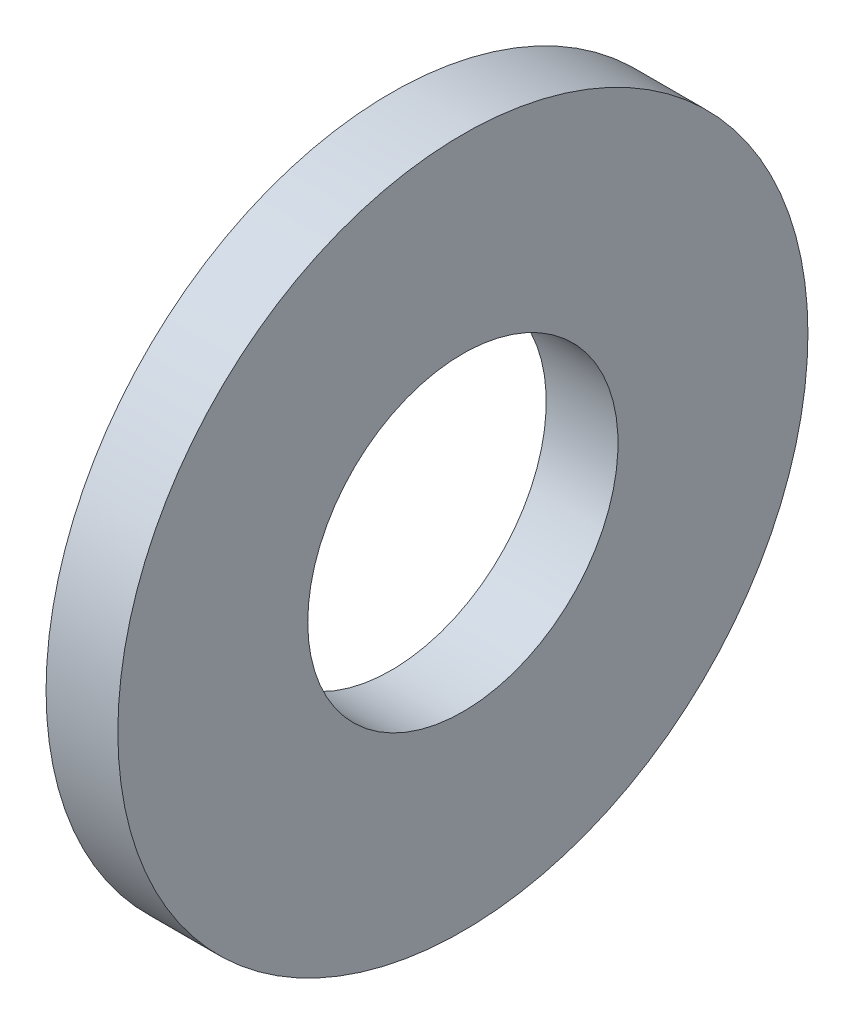
ISO-10303-21;
HEADER;
FILE_DESCRIPTION(('STEP AP214'),'2;1');
FILE_NAME('part.step','',(''),(''),'','','');
FILE_SCHEMA(('AUTOMOTIVE_DESIGN { 1 0 10303 214 1 1 1 1 }'));
ENDSEC;
DATA;
#1=APPLICATION_CONTEXT('core data for automotive mechanical design processes');
#2=APPLICATION_PROTOCOL_DEFINITION('international standard','automotive_design',2000,#1);
#3=PRODUCT_CONTEXT('',#1,'mechanical');
#4=PRODUCT('Part','Part','',(#3));
#5=PRODUCT_RELATED_PRODUCT_CATEGORY('part','',(#4));
#6=PRODUCT_DEFINITION_FORMATION('','',#4);
#7=PRODUCT_DEFINITION_CONTEXT('part definition',#1,'design');
#8=PRODUCT_DEFINITION('design','',#6,#7);
#9=PRODUCT_DEFINITION_SHAPE('','',#8);
#10=(LENGTH_UNIT() NAMED_UNIT(*) SI_UNIT(.MILLI.,.METRE.));
#11=(NAMED_UNIT(*) PLANE_ANGLE_UNIT() SI_UNIT($,.RADIAN.));
#12=(NAMED_UNIT(*) SI_UNIT($,.STERADIAN.) SOLID_ANGLE_UNIT());
#13=UNCERTAINTY_MEASURE_WITH_UNIT(LENGTH_MEASURE(1.E-05),#10,'distance_accuracy_value','');
#14=(GEOMETRIC_REPRESENTATION_CONTEXT(3) GLOBAL_UNCERTAINTY_ASSIGNED_CONTEXT((#13)) GLOBAL_UNIT_ASSIGNED_CONTEXT((#10,
#11,#12)) REPRESENTATION_CONTEXT('',''));
#15=CARTESIAN_POINT('',(0.,0.,0.));
#16=DIRECTION('',(0.,0.,1.));
#17=DIRECTION('',(1.,0.,0.));
#18=AXIS2_PLACEMENT_3D('',#15,#16,#17);
#19=CARTESIAN_POINT('',(-34.9249999999999,0.,0.));
#20=DIRECTION('',(-1.,0.,0.));
#21=DIRECTION('',(0.,0.,1.));
#22=AXIS2_PLACEMENT_3D('',#19,#20,#21);
#23=CYLINDRICAL_SURFACE('',#22,3.5687);
#24=CARTESIAN_POINT('',(0.,0.,0.));
#25=DIRECTION('',(-1.,0.,0.));
#26=DIRECTION('',(0.,0.,1.));
#27=AXIS2_PLACEMENT_3D('',#24,#25,#26);
#28=CIRCLE('',#27,3.5687);
#29=CARTESIAN_POINT('',(0.,0.,3.5687));
#30=VERTEX_POINT('',#29);
#31=EDGE_CURVE('E10',#30,#30,#28,.T.);
#32=ORIENTED_EDGE('',*,*,#31,.F.);
#33=EDGE_LOOP('',(#32));
#34=FACE_BOUND('',#33,.T.);
#35=CARTESIAN_POINT('',(-1.651,0.,0.));
#36=DIRECTION('',(-1.,0.,0.));
#37=DIRECTION('',(0.,0.,1.));
#38=AXIS2_PLACEMENT_3D('',#35,#36,#37);
#39=CIRCLE('',#38,3.5687);
#40=CARTESIAN_POINT('',(-1.651,0.,3.5687));
#41=VERTEX_POINT('',#40);
#42=EDGE_CURVE('E45',#41,#41,#39,.T.);
#43=ORIENTED_EDGE('',*,*,#42,.T.);
#44=EDGE_LOOP('',(#43));
#45=FACE_BOUND('',#44,.T.);
#46=ADVANCED_FACE('F31',(#34,#45),#23,.F.);
#47=CARTESIAN_POINT('',(0.,3.5687,0.));
#48=DIRECTION('',(-1.,0.,0.));
#49=DIRECTION('',(0.,0.,1.));
#50=AXIS2_PLACEMENT_3D('',#47,#48,#49);
#51=PLANE('',#50);
#52=CARTESIAN_POINT('',(0.,0.,0.));
#53=DIRECTION('',(-1.,0.,0.));
#54=DIRECTION('',(0.,0.,1.));
#55=AXIS2_PLACEMENT_3D('',#52,#53,#54);
#56=CIRCLE('',#55,7.9375);
#57=CARTESIAN_POINT('',(0.,0.,7.9375));
#58=VERTEX_POINT('',#57);
#59=EDGE_CURVE('E37',#58,#58,#56,.T.);
#60=ORIENTED_EDGE('',*,*,#59,.F.);
#61=EDGE_LOOP('',(#60));
#62=FACE_BOUND('',#61,.T.);
#63=ORIENTED_EDGE('',*,*,#31,.T.);
#64=EDGE_LOOP('',(#63));
#65=FACE_BOUND('',#64,.T.);
#66=ADVANCED_FACE('F60',(#62,#65),#51,.F.);
#67=CARTESIAN_POINT('',(-34.9249999999999,0.,0.));
#68=DIRECTION('',(-1.,0.,0.));
#69=DIRECTION('',(0.,0.,1.));
#70=AXIS2_PLACEMENT_3D('',#67,#68,#69);
#71=CYLINDRICAL_SURFACE('',#70,7.9375);
#72=CARTESIAN_POINT('',(-1.651,0.,0.));
#73=DIRECTION('',(-1.,0.,0.));
#74=DIRECTION('',(0.,0.,1.));
#75=AXIS2_PLACEMENT_3D('',#72,#73,#74);
#76=CIRCLE('',#75,7.9375);
#77=CARTESIAN_POINT('',(-1.651,0.,7.9375));
#78=VERTEX_POINT('',#77);
#79=EDGE_CURVE('E41',#78,#78,#76,.T.);
#80=ORIENTED_EDGE('',*,*,#79,.F.);
#81=EDGE_LOOP('',(#80));
#82=FACE_BOUND('',#81,.T.);
#83=ORIENTED_EDGE('',*,*,#59,.T.);
#84=EDGE_LOOP('',(#83));
#85=FACE_BOUND('',#84,.T.);
#86=ADVANCED_FACE('F55',(#82,#85),#71,.T.);
#87=CARTESIAN_POINT('',(-1.651,7.9375,0.));
#88=DIRECTION('',(1.,0.,0.));
#89=DIRECTION('',(0.,0.,-1.));
#90=AXIS2_PLACEMENT_3D('',#87,#88,#89);
#91=PLANE('',#90);
#92=ORIENTED_EDGE('',*,*,#42,.F.);
#93=EDGE_LOOP('',(#92));
#94=FACE_BOUND('',#93,.T.);
#95=ORIENTED_EDGE('',*,*,#79,.T.);
#96=EDGE_LOOP('',(#95));
#97=FACE_BOUND('',#96,.T.);
#98=ADVANCED_FACE('F52',(#94,#97),#91,.F.);
#99=CLOSED_SHELL('',(#46,#66,#86,#98));
#100=MANIFOLD_SOLID_BREP('B2',#99);
#101=ADVANCED_BREP_SHAPE_REPRESENTATION('',(#18,#100),#14);
#102=SHAPE_DEFINITION_REPRESENTATION(#9,#101);
ENDSEC;
END-ISO-10303-21;
